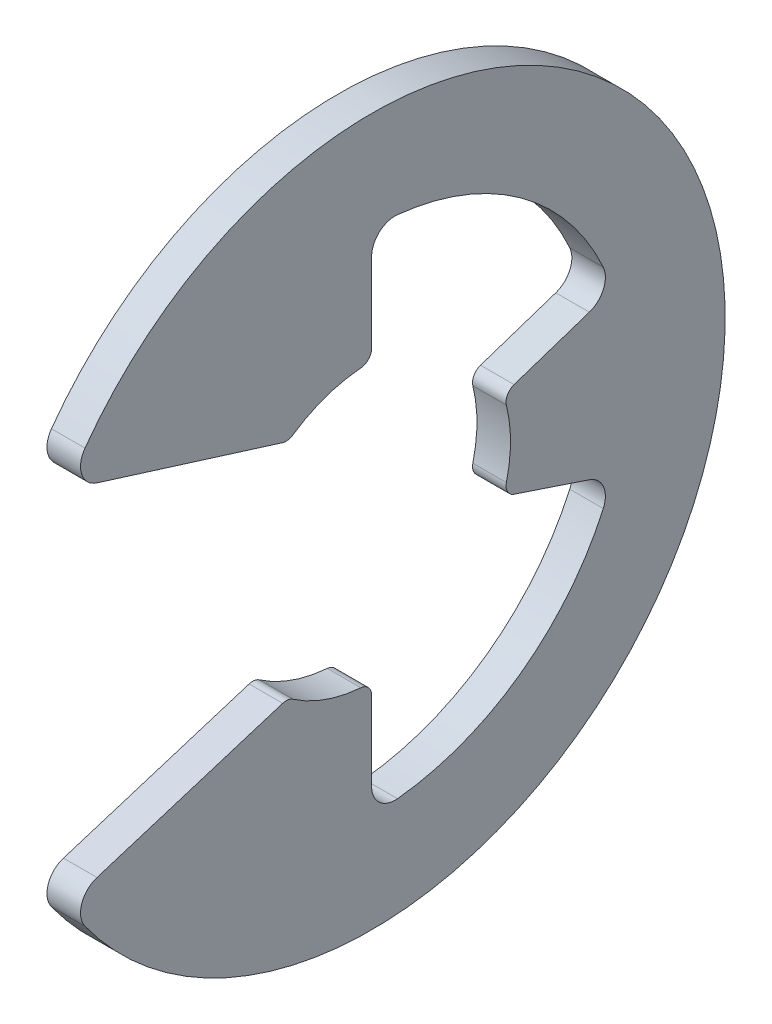
ISO-10303-21;
HEADER;
FILE_DESCRIPTION(('STEP AP214'),'2;1');
FILE_NAME('part.step','',(''),(''),'','','');
FILE_SCHEMA(('AUTOMOTIVE_DESIGN { 1 0 10303 214 1 1 1 1 }'));
ENDSEC;
DATA;
#1=APPLICATION_CONTEXT('core data for automotive mechanical design processes');
#2=APPLICATION_PROTOCOL_DEFINITION('international standard','automotive_design',2000,#1);
#3=PRODUCT_CONTEXT('',#1,'mechanical');
#4=PRODUCT('Part','Part','',(#3));
#5=PRODUCT_RELATED_PRODUCT_CATEGORY('part','',(#4));
#6=PRODUCT_DEFINITION_FORMATION('','',#4);
#7=PRODUCT_DEFINITION_CONTEXT('part definition',#1,'design');
#8=PRODUCT_DEFINITION('design','',#6,#7);
#9=PRODUCT_DEFINITION_SHAPE('','',#8);
#10=(LENGTH_UNIT() NAMED_UNIT(*) SI_UNIT(.MILLI.,.METRE.));
#11=(NAMED_UNIT(*) PLANE_ANGLE_UNIT() SI_UNIT($,.RADIAN.));
#12=(NAMED_UNIT(*) SI_UNIT($,.STERADIAN.) SOLID_ANGLE_UNIT());
#13=UNCERTAINTY_MEASURE_WITH_UNIT(LENGTH_MEASURE(1.E-05),#10,'distance_accuracy_value','');
#14=(GEOMETRIC_REPRESENTATION_CONTEXT(3) GLOBAL_UNCERTAINTY_ASSIGNED_CONTEXT((#13)) GLOBAL_UNIT_ASSIGNED_CONTEXT((#10,
#11,#12)) REPRESENTATION_CONTEXT('',''));
#15=CARTESIAN_POINT('',(0.,0.,0.));
#16=DIRECTION('',(0.,0.,1.));
#17=DIRECTION('',(1.,0.,0.));
#18=AXIS2_PLACEMENT_3D('',#15,#16,#17);
#19=CARTESIAN_POINT('',(0.3175,0.,0.));
#20=DIRECTION('',(-1.,0.,0.));
#21=DIRECTION('',(0.,0.,1.));
#22=AXIS2_PLACEMENT_3D('',#19,#20,#21);
#23=CYLINDRICAL_SURFACE('',#22,2.6289);
#24=CARTESIAN_POINT('',(0.3175,0.,0.));
#25=DIRECTION('',(-1.,0.,0.));
#26=DIRECTION('',(0.,0.,-1.));
#27=AXIS2_PLACEMENT_3D('',#24,#25,#26);
#28=CIRCLE('',#27,2.6289);
#29=CARTESIAN_POINT('',(0.3175,0.634392297731757,-2.55120787521884));
#30=VERTEX_POINT('',#29);
#31=CARTESIAN_POINT('',(0.3175,-0.634392297731756,-2.55120787521884));
#32=VERTEX_POINT('',#31);
#33=EDGE_CURVE('E246',#30,#32,#28,.T.);
#34=ORIENTED_EDGE('',*,*,#33,.F.);
#35=DIRECTION('',(-1.,0.,0.));
#36=VECTOR('',#35,1.);
#37=CARTESIAN_POINT('',(0.3175,0.634392297731757,-2.55120787521884));
#38=LINE('',#37,#36);
#39=CARTESIAN_POINT('',(-0.3175,0.634392297731757,-2.55120787521884));
#40=VERTEX_POINT('',#39);
#41=EDGE_CURVE('E360',#30,#40,#38,.T.);
#42=ORIENTED_EDGE('',*,*,#41,.T.);
#43=CARTESIAN_POINT('',(-0.3175,0.,0.));
#44=DIRECTION('',(-1.,0.,0.));
#45=DIRECTION('',(0.,0.,-1.));
#46=AXIS2_PLACEMENT_3D('',#43,#44,#45);
#47=CIRCLE('',#46,2.6289);
#48=CARTESIAN_POINT('',(-0.3175,-0.634392297731756,-2.55120787521884));
#49=VERTEX_POINT('',#48);
#50=EDGE_CURVE('E419',#40,#49,#47,.T.);
#51=ORIENTED_EDGE('',*,*,#50,.T.);
#52=DIRECTION('',(-1.,0.,0.));
#53=VECTOR('',#52,1.);
#54=CARTESIAN_POINT('',(0.3175,-0.634392297731757,-2.55120787521884));
#55=LINE('',#54,#53);
#56=EDGE_CURVE('E60',#49,#32,#55,.F.);
#57=ORIENTED_EDGE('',*,*,#56,.T.);
#58=EDGE_LOOP('',(#34,#42,#51,#57));
#59=FACE_BOUND('',#58,.T.);
#60=ADVANCED_FACE('F37',(#59),#23,.F.);
#61=CARTESIAN_POINT('',(0.3175,-0.831331174081665,-2.493993522245));
#62=DIRECTION('',(0.,0.948683298050514,-0.316227766016838));
#63=DIRECTION('',(0.,0.316227766016838,0.948683298050514));
#64=AXIS2_PLACEMENT_3D('',#61,#62,#63);
#65=PLANE('',#64);
#66=DIRECTION('',(0.,-0.316227766016838,-0.948683298050514));
#67=VECTOR('',#66,1.);
#68=CARTESIAN_POINT('',(0.3175,-0.831331174081665,-2.493993522245));
#69=LINE('',#68,#67);
#70=CARTESIAN_POINT('',(0.3175,-0.898869359807086,-2.69660807942126));
#71=VERTEX_POINT('',#70);
#72=CARTESIAN_POINT('',(0.3175,-1.37371537804572,-4.12114613413716));
#73=VERTEX_POINT('',#72);
#74=EDGE_CURVE('E248',#71,#73,#69,.T.);
#75=ORIENTED_EDGE('',*,*,#74,.F.);
#76=DIRECTION('',(-1.,0.,0.));
#77=VECTOR('',#76,1.);
#78=CARTESIAN_POINT('',(0.3175,-0.898869359807086,-2.69660807942126));
#79=LINE('',#78,#77);
#80=CARTESIAN_POINT('',(-0.3175,-0.898869359807086,-2.69660807942126));
#81=VERTEX_POINT('',#80);
#82=EDGE_CURVE('E365',#71,#81,#79,.T.);
#83=ORIENTED_EDGE('',*,*,#82,.T.);
#84=DIRECTION('',(0.,-0.316227766016838,-0.948683298050514));
#85=VECTOR('',#84,1.);
#86=CARTESIAN_POINT('',(-0.3175,-0.831331174081665,-2.493993522245));
#87=LINE('',#86,#85);
#88=CARTESIAN_POINT('',(-0.3175,-1.37371537804572,-4.12114613413716));
#89=VERTEX_POINT('',#88);
#90=EDGE_CURVE('E421',#81,#89,#87,.T.);
#91=ORIENTED_EDGE('',*,*,#90,.T.);
#92=DIRECTION('',(1.,0.,0.));
#93=VECTOR('',#92,1.);
#94=CARTESIAN_POINT('',(0.3175,-1.37371537804572,-4.12114613413716));
#95=LINE('',#94,#93);
#96=EDGE_CURVE('E294',#89,#73,#95,.T.);
#97=ORIENTED_EDGE('',*,*,#96,.T.);
#98=EDGE_LOOP('',(#75,#83,#91,#97));
#99=FACE_BOUND('',#98,.T.);
#100=ADVANCED_FACE('F457',(#99),#65,.F.);
#101=CARTESIAN_POINT('',(0.3175,0.,0.));
#102=DIRECTION('',(-1.,0.,0.));
#103=DIRECTION('',(0.,0.,1.));
#104=AXIS2_PLACEMENT_3D('',#101,#102,#103);
#105=CYLINDRICAL_SURFACE('',#104,4.81125161290323);
#106=CARTESIAN_POINT('',(-0.3175,0.,0.));
#107=DIRECTION('',(-1.,0.,0.));
#108=DIRECTION('',(0.,0.,-1.));
#109=AXIS2_PLACEMENT_3D('',#106,#107,#108);
#110=CIRCLE('',#109,4.81125161290323);
#111=CARTESIAN_POINT('',(-0.3175,-1.97816282406592,-4.38577403933986));
#112=VERTEX_POINT('',#111);
#113=CARTESIAN_POINT('',(-0.3175,-4.78626059081718,-0.489746505300684));
#114=VERTEX_POINT('',#113);
#115=EDGE_CURVE('E423',#112,#114,#110,.T.);
#116=ORIENTED_EDGE('',*,*,#115,.T.);
#117=DIRECTION('',(-1.,0.,0.));
#118=VECTOR('',#117,1.);
#119=CARTESIAN_POINT('',(0.3175,-4.78626059081718,-0.489746505300684));
#120=LINE('',#119,#118);
#121=CARTESIAN_POINT('',(0.3175,-4.78626059081718,-0.489746505300684));
#122=VERTEX_POINT('',#121);
#123=EDGE_CURVE('E292',#114,#122,#120,.F.);
#124=ORIENTED_EDGE('',*,*,#123,.T.);
#125=CARTESIAN_POINT('',(0.3175,0.,0.));
#126=DIRECTION('',(-1.,0.,0.));
#127=DIRECTION('',(0.,0.,-1.));
#128=AXIS2_PLACEMENT_3D('',#125,#126,#127);
#129=CIRCLE('',#128,4.81125161290323);
#130=CARTESIAN_POINT('',(0.3175,-1.97816282406592,-4.38577403933986));
#131=VERTEX_POINT('',#130);
#132=EDGE_CURVE('E250',#131,#122,#129,.T.);
#133=ORIENTED_EDGE('',*,*,#132,.F.);
#134=DIRECTION('',(-1.,0.,0.));
#135=VECTOR('',#134,1.);
#136=CARTESIAN_POINT('',(0.3175,-1.97816282406592,-4.38577403933986));
#137=LINE('',#136,#135);
#138=EDGE_CURVE('E289',#131,#112,#137,.T.);
#139=ORIENTED_EDGE('',*,*,#138,.T.);
#140=EDGE_LOOP('',(#116,#124,#133,#139));
#141=FACE_BOUND('',#140,.T.);
#142=ADVANCED_FACE('F462',(#141),#105,.F.);
#143=CARTESIAN_POINT('',(0.3175,-4.81125161290323,0.));
#144=DIRECTION('',(0.,0.,1.));
#145=DIRECTION('',(0.,-1.,0.));
#146=AXIS2_PLACEMENT_3D('',#143,#144,#145);
#147=PLANE('',#146);
#148=DIRECTION('',(0.,1.,0.));
#149=VECTOR('',#148,1.);
#150=CARTESIAN_POINT('',(-0.3175,-4.81125161290323,0.));
#151=LINE('',#150,#149);
#152=CARTESIAN_POINT('',(-0.3175,-4.34406945142374,0.));
#153=VERTEX_POINT('',#152);
#154=CARTESIAN_POINT('',(-0.3175,-2.8424744959278,0.));
#155=VERTEX_POINT('',#154);
#156=EDGE_CURVE('E428',#153,#155,#151,.T.);
#157=ORIENTED_EDGE('',*,*,#156,.T.);
#158=DIRECTION('',(-1.,0.,0.));
#159=VECTOR('',#158,1.);
#160=CARTESIAN_POINT('',(0.3175,-2.8424744959278,0.));
#161=LINE('',#160,#159);
#162=CARTESIAN_POINT('',(0.3175,-2.8424744959278,0.));
#163=VERTEX_POINT('',#162);
#164=EDGE_CURVE('E343',#155,#163,#161,.F.);
#165=ORIENTED_EDGE('',*,*,#164,.T.);
#166=DIRECTION('',(0.,1.,0.));
#167=VECTOR('',#166,1.);
#168=CARTESIAN_POINT('',(0.3175,-4.81125161290323,0.));
#169=LINE('',#168,#167);
#170=CARTESIAN_POINT('',(0.3175,-4.34406945142374,0.));
#171=VERTEX_POINT('',#170);
#172=EDGE_CURVE('E253',#171,#163,#169,.T.);
#173=ORIENTED_EDGE('',*,*,#172,.F.);
#174=DIRECTION('',(1.,0.,0.));
#175=VECTOR('',#174,1.);
#176=CARTESIAN_POINT('',(-0.3175,-4.34406945142374,0.));
#177=LINE('',#176,#175);
#178=EDGE_CURVE('E286',#171,#153,#177,.F.);
#179=ORIENTED_EDGE('',*,*,#178,.T.);
#180=EDGE_LOOP('',(#157,#165,#173,#179));
#181=FACE_BOUND('',#180,.T.);
#182=ADVANCED_FACE('F468',(#181),#147,.F.);
#183=CARTESIAN_POINT('',(0.3175,0.,0.));
#184=DIRECTION('',(-1.,0.,0.));
#185=DIRECTION('',(0.,0.,1.));
#186=AXIS2_PLACEMENT_3D('',#183,#184,#185);
#187=CYLINDRICAL_SURFACE('',#186,2.6289);
#188=CARTESIAN_POINT('',(0.3175,0.,0.));
#189=DIRECTION('',(-1.,0.,0.));
#190=DIRECTION('',(0.,0.,-1.));
#191=AXIS2_PLACEMENT_3D('',#188,#189,#190);
#192=CIRCLE('',#191,2.6289);
#193=CARTESIAN_POINT('',(0.3175,-2.62090076016505,0.204925389755011));
#194=VERTEX_POINT('',#193);
#195=CARTESIAN_POINT('',(0.3175,-2.16527043809185,1.490878646948));
#196=VERTEX_POINT('',#195);
#197=EDGE_CURVE('E256',#194,#196,#192,.T.);
#198=ORIENTED_EDGE('',*,*,#197,.F.);
#199=DIRECTION('',(-1.,0.,0.));
#200=VECTOR('',#199,1.);
#201=CARTESIAN_POINT('',(0.3175,-2.62090076016505,0.204925389755011));
#202=LINE('',#201,#200);
#203=CARTESIAN_POINT('',(-0.3175,-2.62090076016505,0.204925389755011));
#204=VERTEX_POINT('',#203);
#205=EDGE_CURVE('E328',#194,#204,#202,.T.);
#206=ORIENTED_EDGE('',*,*,#205,.T.);
#207=CARTESIAN_POINT('',(-0.3175,0.,0.));
#208=DIRECTION('',(-1.,0.,0.));
#209=DIRECTION('',(0.,0.,-1.));
#210=AXIS2_PLACEMENT_3D('',#207,#208,#209);
#211=CIRCLE('',#210,2.6289);
#212=CARTESIAN_POINT('',(-0.3175,-2.16527043809185,1.490878646948));
#213=VERTEX_POINT('',#212);
#214=EDGE_CURVE('E232',#204,#213,#211,.T.);
#215=ORIENTED_EDGE('',*,*,#214,.T.);
#216=DIRECTION('',(-1.,0.,0.));
#217=VECTOR('',#216,1.);
#218=CARTESIAN_POINT('',(0.3175,-2.16527043809185,1.490878646948));
#219=LINE('',#218,#217);
#220=EDGE_CURVE('E326',#213,#196,#219,.F.);
#221=ORIENTED_EDGE('',*,*,#220,.T.);
#222=EDGE_LOOP('',(#198,#206,#215,#221));
#223=FACE_BOUND('',#222,.T.);
#224=ADVANCED_FACE('F434',(#223),#187,.F.);
#225=CARTESIAN_POINT('',(0.3175,-2.10312,1.57734));
#226=DIRECTION('',(0.,-0.954513538836349,-0.29816757734219));
#227=DIRECTION('',(0.,0.29816757734219,-0.954513538836349));
#228=AXIS2_PLACEMENT_3D('',#225,#226,#227);
#229=PLANE('',#228);
#230=DIRECTION('',(0.,-0.29816757734219,0.954513538836348));
#231=VECTOR('',#230,1.);
#232=CARTESIAN_POINT('',(0.3175,-2.10312,1.57734));
#233=LINE('',#232,#231);
#234=CARTESIAN_POINT('',(0.3175,-2.13618406817537,1.683186856334));
#235=VERTEX_POINT('',#234);
#236=CARTESIAN_POINT('',(0.3175,-3.2341191064352,5.19796826926775));
#237=VERTEX_POINT('',#236);
#238=EDGE_CURVE('E259',#235,#237,#233,.T.);
#239=ORIENTED_EDGE('',*,*,#238,.F.);
#240=DIRECTION('',(-1.,0.,0.));
#241=VECTOR('',#240,1.);
#242=CARTESIAN_POINT('',(0.3175,-2.13618406817537,1.683186856334));
#243=LINE('',#242,#241);
#244=CARTESIAN_POINT('',(-0.3175,-2.13618406817537,1.683186856334));
#245=VERTEX_POINT('',#244);
#246=EDGE_CURVE('E356',#235,#245,#243,.T.);
#247=ORIENTED_EDGE('',*,*,#246,.T.);
#248=DIRECTION('',(0.,-0.29816757734219,0.954513538836348));
#249=VECTOR('',#248,1.);
#250=CARTESIAN_POINT('',(-0.3175,-2.10312,1.57734));
#251=LINE('',#250,#249);
#252=CARTESIAN_POINT('',(-0.3175,-3.2341191064352,5.19796826926775));
#253=VERTEX_POINT('',#252);
#254=EDGE_CURVE('E227',#245,#253,#251,.T.);
#255=ORIENTED_EDGE('',*,*,#254,.T.);
#256=DIRECTION('',(-1.,0.,0.));
#257=VECTOR('',#256,1.);
#258=CARTESIAN_POINT('',(0.3175,-3.2341191064352,5.19796826926775));
#259=LINE('',#258,#257);
#260=EDGE_CURVE('E207',#253,#237,#259,.F.);
#261=ORIENTED_EDGE('',*,*,#260,.T.);
#262=EDGE_LOOP('',(#239,#247,#255,#261));
#263=FACE_BOUND('',#262,.T.);
#264=ADVANCED_FACE('F442',(#263),#229,.F.);
#265=CARTESIAN_POINT('',(0.3175,0.,0.));
#266=DIRECTION('',(-1.,0.,0.));
#267=DIRECTION('',(0.,0.,1.));
#268=AXIS2_PLACEMENT_3D('',#265,#266,#267);
#269=CYLINDRICAL_SURFACE('',#268,6.6929);
#270=CARTESIAN_POINT('',(0.3175,0.,0.));
#271=DIRECTION('',(1.,0.,0.));
#272=DIRECTION('',(0.,0.,-1.));
#273=AXIS2_PLACEMENT_3D('',#270,#271,#272);
#274=CIRCLE('',#273,6.6929);
#275=CARTESIAN_POINT('',(0.3175,-3.91865243360584,5.42577860906571));
#276=VERTEX_POINT('',#275);
#277=CARTESIAN_POINT('',(0.3175,3.91865243360584,5.42577860906571));
#278=VERTEX_POINT('',#277);
#279=EDGE_CURVE('E220',#276,#278,#274,.T.);
#280=ORIENTED_EDGE('',*,*,#279,.F.);
#281=DIRECTION('',(-1.,0.,0.));
#282=VECTOR('',#281,1.);
#283=CARTESIAN_POINT('',(0.3175,-3.91865243360584,5.42577860906571));
#284=LINE('',#283,#282);
#285=CARTESIAN_POINT('',(-0.3175,-3.91865243360584,5.42577860906571));
#286=VERTEX_POINT('',#285);
#287=EDGE_CURVE('E205',#276,#286,#284,.T.);
#288=ORIENTED_EDGE('',*,*,#287,.T.);
#289=CARTESIAN_POINT('',(-0.3175,0.,0.));
#290=DIRECTION('',(1.,0.,0.));
#291=DIRECTION('',(0.,0.,-1.));
#292=AXIS2_PLACEMENT_3D('',#289,#290,#291);
#293=CIRCLE('',#292,6.6929);
#294=CARTESIAN_POINT('',(-0.3175,3.91865243360584,5.42577860906571));
#295=VERTEX_POINT('',#294);
#296=EDGE_CURVE('E217',#286,#295,#293,.T.);
#297=ORIENTED_EDGE('',*,*,#296,.T.);
#298=DIRECTION('',(-1.,0.,0.));
#299=VECTOR('',#298,1.);
#300=CARTESIAN_POINT('',(0.3175,3.91865243360584,5.42577860906571));
#301=LINE('',#300,#299);
#302=EDGE_CURVE('E221',#295,#278,#301,.F.);
#303=ORIENTED_EDGE('',*,*,#302,.T.);
#304=EDGE_LOOP('',(#280,#288,#297,#303));
#305=FACE_BOUND('',#304,.T.);
#306=ADVANCED_FACE('F216',(#305),#269,.T.);
#307=CARTESIAN_POINT('',(0.3175,3.40948689870738,5.75936710911388));
#308=DIRECTION('',(0.,0.954513538836349,-0.298167577342189));
#309=DIRECTION('',(0.,0.298167577342189,0.954513538836349));
#310=AXIS2_PLACEMENT_3D('',#307,#308,#309);
#311=PLANE('',#310);
#312=DIRECTION('',(0.,-0.298167577342189,-0.954513538836349));
#313=VECTOR('',#312,1.);
#314=CARTESIAN_POINT('',(-0.3175,3.40948689870738,5.75936710911388));
#315=LINE('',#314,#313);
#316=CARTESIAN_POINT('',(-0.3175,3.2341191064352,5.19796826926775));
#317=VERTEX_POINT('',#316);
#318=CARTESIAN_POINT('',(-0.3175,2.13618406817537,1.683186856334));
#319=VERTEX_POINT('',#318);
#320=EDGE_CURVE('E226',#317,#319,#315,.T.);
#321=ORIENTED_EDGE('',*,*,#320,.T.);
#322=DIRECTION('',(-1.,0.,0.));
#323=VECTOR('',#322,1.);
#324=CARTESIAN_POINT('',(0.3175,2.13618406817537,1.683186856334));
#325=LINE('',#324,#323);
#326=CARTESIAN_POINT('',(0.3175,2.13618406817537,1.683186856334));
#327=VERTEX_POINT('',#326);
#328=EDGE_CURVE('E45',#319,#327,#325,.F.);
#329=ORIENTED_EDGE('',*,*,#328,.T.);
#330=DIRECTION('',(0.,-0.298167577342189,-0.954513538836349));
#331=VECTOR('',#330,1.);
#332=CARTESIAN_POINT('',(0.3175,3.40948689870738,5.75936710911388));
#333=LINE('',#332,#331);
#334=CARTESIAN_POINT('',(0.3175,3.2341191064352,5.19796826926775));
#335=VERTEX_POINT('',#334);
#336=EDGE_CURVE('E262',#335,#327,#333,.T.);
#337=ORIENTED_EDGE('',*,*,#336,.F.);
#338=DIRECTION('',(-1.,0.,0.));
#339=VECTOR('',#338,1.);
#340=CARTESIAN_POINT('',(0.3175,3.2341191064352,5.19796826926775));
#341=LINE('',#340,#339);
#342=EDGE_CURVE('E283',#335,#317,#341,.T.);
#343=ORIENTED_EDGE('',*,*,#342,.T.);
#344=EDGE_LOOP('',(#321,#329,#337,#343));
#345=FACE_BOUND('',#344,.T.);
#346=ADVANCED_FACE('F375',(#345),#311,.F.);
#347=CARTESIAN_POINT('',(0.3175,0.,0.));
#348=DIRECTION('',(-1.,0.,0.));
#349=DIRECTION('',(0.,0.,1.));
#350=AXIS2_PLACEMENT_3D('',#347,#348,#349);
#351=CYLINDRICAL_SURFACE('',#350,2.6289);
#352=CARTESIAN_POINT('',(0.3175,0.,0.));
#353=DIRECTION('',(-1.,0.,0.));
#354=DIRECTION('',(0.,0.,-1.));
#355=AXIS2_PLACEMENT_3D('',#352,#353,#354);
#356=CIRCLE('',#355,2.6289);
#357=CARTESIAN_POINT('',(0.3175,2.16527043809185,1.49087864694801));
#358=VERTEX_POINT('',#357);
#359=CARTESIAN_POINT('',(0.3175,2.62090076016505,0.204925389755012));
#360=VERTEX_POINT('',#359);
#361=EDGE_CURVE('E265',#358,#360,#356,.T.);
#362=ORIENTED_EDGE('',*,*,#361,.F.);
#363=DIRECTION('',(-1.,0.,0.));
#364=VECTOR('',#363,1.);
#365=CARTESIAN_POINT('',(0.3175,2.16527043809185,1.49087864694801));
#366=LINE('',#365,#364);
#367=CARTESIAN_POINT('',(-0.3175,2.16527043809185,1.49087864694801));
#368=VERTEX_POINT('',#367);
#369=EDGE_CURVE('E370',#358,#368,#366,.T.);
#370=ORIENTED_EDGE('',*,*,#369,.T.);
#371=CARTESIAN_POINT('',(-0.3175,0.,0.));
#372=DIRECTION('',(-1.,0.,0.));
#373=DIRECTION('',(0.,0.,-1.));
#374=AXIS2_PLACEMENT_3D('',#371,#372,#373);
#375=CIRCLE('',#374,2.6289);
#376=CARTESIAN_POINT('',(-0.3175,2.62090076016505,0.204925389755012));
#377=VERTEX_POINT('',#376);
#378=EDGE_CURVE('E230',#368,#377,#375,.T.);
#379=ORIENTED_EDGE('',*,*,#378,.T.);
#380=DIRECTION('',(-1.,0.,0.));
#381=VECTOR('',#380,1.);
#382=CARTESIAN_POINT('',(0.3175,2.62090076016505,0.204925389755012));
#383=LINE('',#382,#381);
#384=EDGE_CURVE('E368',#377,#360,#383,.F.);
#385=ORIENTED_EDGE('',*,*,#384,.T.);
#386=EDGE_LOOP('',(#362,#370,#379,#385));
#387=FACE_BOUND('',#386,.T.);
#388=ADVANCED_FACE('F386',(#387),#351,.F.);
#389=CARTESIAN_POINT('',(0.3175,2.6289,0.));
#390=DIRECTION('',(0.,0.,1.));
#391=DIRECTION('',(0.,-1.,0.));
#392=AXIS2_PLACEMENT_3D('',#389,#390,#391);
#393=PLANE('',#392);
#394=DIRECTION('',(0.,1.,0.));
#395=VECTOR('',#394,1.);
#396=CARTESIAN_POINT('',(0.3175,2.6289,0.));
#397=LINE('',#396,#395);
#398=CARTESIAN_POINT('',(0.3175,2.8424744959278,0.));
#399=VERTEX_POINT('',#398);
#400=CARTESIAN_POINT('',(0.3175,4.34406945142374,0.));
#401=VERTEX_POINT('',#400);
#402=EDGE_CURVE('E268',#399,#401,#397,.T.);
#403=ORIENTED_EDGE('',*,*,#402,.F.);
#404=DIRECTION('',(-1.,0.,0.));
#405=VECTOR('',#404,1.);
#406=CARTESIAN_POINT('',(0.3175,2.8424744959278,0.));
#407=LINE('',#406,#405);
#408=CARTESIAN_POINT('',(-0.3175,2.8424744959278,0.));
#409=VERTEX_POINT('',#408);
#410=EDGE_CURVE('E11',#399,#409,#407,.T.);
#411=ORIENTED_EDGE('',*,*,#410,.T.);
#412=DIRECTION('',(0.,1.,0.));
#413=VECTOR('',#412,1.);
#414=CARTESIAN_POINT('',(-0.3175,2.6289,0.));
#415=LINE('',#414,#413);
#416=CARTESIAN_POINT('',(-0.3175,4.34406945142374,0.));
#417=VERTEX_POINT('',#416);
#418=EDGE_CURVE('E238',#409,#417,#415,.T.);
#419=ORIENTED_EDGE('',*,*,#418,.T.);
#420=DIRECTION('',(1.,0.,0.));
#421=VECTOR('',#420,1.);
#422=CARTESIAN_POINT('',(0.3175,4.34406945142374,0.));
#423=LINE('',#422,#421);
#424=EDGE_CURVE('E305',#417,#401,#423,.T.);
#425=ORIENTED_EDGE('',*,*,#424,.T.);
#426=EDGE_LOOP('',(#403,#411,#419,#425));
#427=FACE_BOUND('',#426,.T.);
#428=ADVANCED_FACE('F394',(#427),#393,.F.);
#429=CARTESIAN_POINT('',(0.3175,0.,0.));
#430=DIRECTION('',(-1.,0.,0.));
#431=DIRECTION('',(0.,0.,1.));
#432=AXIS2_PLACEMENT_3D('',#429,#430,#431);
#433=CYLINDRICAL_SURFACE('',#432,4.81125161290323);
#434=CARTESIAN_POINT('',(-0.3175,0.,0.));
#435=DIRECTION('',(-1.,0.,0.));
#436=DIRECTION('',(0.,0.,-1.));
#437=AXIS2_PLACEMENT_3D('',#434,#435,#436);
#438=CIRCLE('',#437,4.81125161290323);
#439=CARTESIAN_POINT('',(-0.3175,4.78626059081718,-0.489746505300684));
#440=VERTEX_POINT('',#439);
#441=CARTESIAN_POINT('',(-0.3175,1.97816282406592,-4.38577403933986));
#442=VERTEX_POINT('',#441);
#443=EDGE_CURVE('E240',#440,#442,#438,.T.);
#444=ORIENTED_EDGE('',*,*,#443,.T.);
#445=DIRECTION('',(-1.,0.,0.));
#446=VECTOR('',#445,1.);
#447=CARTESIAN_POINT('',(0.3175,1.97816282406592,-4.38577403933986));
#448=LINE('',#447,#446);
#449=CARTESIAN_POINT('',(0.3175,1.97816282406592,-4.38577403933986));
#450=VERTEX_POINT('',#449);
#451=EDGE_CURVE('E303',#442,#450,#448,.F.);
#452=ORIENTED_EDGE('',*,*,#451,.T.);
#453=CARTESIAN_POINT('',(0.3175,0.,0.));
#454=DIRECTION('',(-1.,0.,0.));
#455=DIRECTION('',(0.,0.,-1.));
#456=AXIS2_PLACEMENT_3D('',#453,#454,#455);
#457=CIRCLE('',#456,4.81125161290323);
#458=CARTESIAN_POINT('',(0.3175,4.78626059081718,-0.489746505300684));
#459=VERTEX_POINT('',#458);
#460=EDGE_CURVE('E270',#459,#450,#457,.T.);
#461=ORIENTED_EDGE('',*,*,#460,.F.);
#462=DIRECTION('',(-1.,0.,0.));
#463=VECTOR('',#462,1.);
#464=CARTESIAN_POINT('',(0.3175,4.78626059081718,-0.489746505300684));
#465=LINE('',#464,#463);
#466=EDGE_CURVE('E300',#459,#440,#465,.T.);
#467=ORIENTED_EDGE('',*,*,#466,.T.);
#468=EDGE_LOOP('',(#444,#452,#461,#467));
#469=FACE_BOUND('',#468,.T.);
#470=ADVANCED_FACE('F402',(#469),#433,.F.);
#471=CARTESIAN_POINT('',(0.3175,1.5214513492933,-4.56435404787989));
#472=DIRECTION('',(0.,-0.948683298050514,-0.316227766016838));
#473=DIRECTION('',(0.,0.316227766016838,-0.948683298050514));
#474=AXIS2_PLACEMENT_3D('',#471,#472,#473);
#475=PLANE('',#474);
#476=DIRECTION('',(0.,-0.316227766016838,0.948683298050514));
#477=VECTOR('',#476,1.);
#478=CARTESIAN_POINT('',(-0.3175,1.5214513492933,-4.56435404787989));
#479=LINE('',#478,#477);
#480=CARTESIAN_POINT('',(-0.3175,1.37371537804572,-4.12114613413716));
#481=VERTEX_POINT('',#480);
#482=CARTESIAN_POINT('',(-0.3175,0.898869359807086,-2.69660807942126));
#483=VERTEX_POINT('',#482);
#484=EDGE_CURVE('E243',#481,#483,#479,.T.);
#485=ORIENTED_EDGE('',*,*,#484,.T.);
#486=DIRECTION('',(-1.,0.,0.));
#487=VECTOR('',#486,1.);
#488=CARTESIAN_POINT('',(0.3175,0.898869359807086,-2.69660807942126));
#489=LINE('',#488,#487);
#490=CARTESIAN_POINT('',(0.3175,0.898869359807086,-2.69660807942126));
#491=VERTEX_POINT('',#490);
#492=EDGE_CURVE('E363',#483,#491,#489,.F.);
#493=ORIENTED_EDGE('',*,*,#492,.T.);
#494=DIRECTION('',(0.,-0.316227766016838,0.948683298050514));
#495=VECTOR('',#494,1.);
#496=CARTESIAN_POINT('',(0.3175,1.5214513492933,-4.56435404787989));
#497=LINE('',#496,#495);
#498=CARTESIAN_POINT('',(0.3175,1.37371537804572,-4.12114613413716));
#499=VERTEX_POINT('',#498);
#500=EDGE_CURVE('E273',#499,#491,#497,.T.);
#501=ORIENTED_EDGE('',*,*,#500,.F.);
#502=DIRECTION('',(1.,0.,0.));
#503=VECTOR('',#502,1.);
#504=CARTESIAN_POINT('',(-0.3175,1.37371537804572,-4.12114613413716));
#505=LINE('',#504,#503);
#506=EDGE_CURVE('E297',#499,#481,#505,.F.);
#507=ORIENTED_EDGE('',*,*,#506,.T.);
#508=EDGE_LOOP('',(#485,#493,#501,#507));
#509=FACE_BOUND('',#508,.T.);
#510=ADVANCED_FACE('F413',(#509),#475,.F.);
#511=CARTESIAN_POINT('',(0.3175,0.,0.));
#512=DIRECTION('',(1.,0.,0.));
#513=DIRECTION('',(0.,0.,-1.));
#514=AXIS2_PLACEMENT_3D('',#511,#512,#513);
#515=PLANE('',#514);
#516=ORIENTED_EDGE('',*,*,#172,.T.);
#517=CARTESIAN_POINT('',(0.3175,-2.8424744959278,0.22225));
#518=DIRECTION('',(1.,0.,0.));
#519=DIRECTION('',(0.,0.,-1.));
#520=AXIS2_PLACEMENT_3D('',#517,#518,#519);
#521=CIRCLE('',#520,0.22225);
#522=EDGE_CURVE('E354',#163,#194,#521,.T.);
#523=ORIENTED_EDGE('',*,*,#522,.T.);
#524=ORIENTED_EDGE('',*,*,#197,.T.);
#525=CARTESIAN_POINT('',(0.3175,-2.34832470218174,1.6169191122697));
#526=DIRECTION('',(1.,0.,0.));
#527=DIRECTION('',(0.,0.,-1.));
#528=AXIS2_PLACEMENT_3D('',#525,#526,#527);
#529=CIRCLE('',#528,0.22225);
#530=EDGE_CURVE('E352',#196,#235,#529,.T.);
#531=ORIENTED_EDGE('',*,*,#530,.T.);
#532=ORIENTED_EDGE('',*,*,#238,.T.);
#533=CARTESIAN_POINT('',(0.3175,-3.65840037444796,5.06543278113915));
#534=DIRECTION('',(1.,0.,0.));
#535=DIRECTION('',(0.,0.,-1.));
#536=AXIS2_PLACEMENT_3D('',#533,#534,#535);
#537=CIRCLE('',#536,0.4445);
#538=EDGE_CURVE('E281',#237,#276,#537,.T.);
#539=ORIENTED_EDGE('',*,*,#538,.T.);
#540=ORIENTED_EDGE('',*,*,#279,.T.);
#541=CARTESIAN_POINT('',(0.3175,3.65840037444795,5.06543278113915));
#542=DIRECTION('',(1.,0.,0.));
#543=DIRECTION('',(0.,0.,-1.));
#544=AXIS2_PLACEMENT_3D('',#541,#542,#543);
#545=CIRCLE('',#544,0.4445);
#546=EDGE_CURVE('E279',#278,#335,#545,.T.);
#547=ORIENTED_EDGE('',*,*,#546,.T.);
#548=ORIENTED_EDGE('',*,*,#336,.T.);
#549=CARTESIAN_POINT('',(0.3175,2.34832470218174,1.6169191122697));
#550=DIRECTION('',(1.,0.,0.));
#551=DIRECTION('',(0.,0.,-1.));
#552=AXIS2_PLACEMENT_3D('',#549,#550,#551);
#553=CIRCLE('',#552,0.22225);
#554=EDGE_CURVE('E347',#327,#358,#553,.T.);
#555=ORIENTED_EDGE('',*,*,#554,.T.);
#556=ORIENTED_EDGE('',*,*,#361,.T.);
#557=CARTESIAN_POINT('',(0.3175,2.8424744959278,0.222250000000001));
#558=DIRECTION('',(1.,0.,0.));
#559=DIRECTION('',(0.,0.,-1.));
#560=AXIS2_PLACEMENT_3D('',#557,#558,#559);
#561=CIRCLE('',#560,0.22225);
#562=EDGE_CURVE('E345',#360,#399,#561,.T.);
#563=ORIENTED_EDGE('',*,*,#562,.T.);
#564=ORIENTED_EDGE('',*,*,#402,.T.);
#565=CARTESIAN_POINT('',(0.3175,4.34406945142374,-0.444499999999999));
#566=DIRECTION('',(1.,0.,0.));
#567=DIRECTION('',(0.,0.,-1.));
#568=AXIS2_PLACEMENT_3D('',#565,#566,#567);
#569=CIRCLE('',#568,0.4445);
#570=EDGE_CURVE('E324',#401,#459,#569,.F.);
#571=ORIENTED_EDGE('',*,*,#570,.T.);
#572=ORIENTED_EDGE('',*,*,#460,.T.);
#573=CARTESIAN_POINT('',(0.3175,1.79540510402917,-3.98058289214267));
#574=DIRECTION('',(1.,0.,0.));
#575=DIRECTION('',(0.,0.,-1.));
#576=AXIS2_PLACEMENT_3D('',#573,#574,#575);
#577=CIRCLE('',#576,0.4445);
#578=EDGE_CURVE('E319',#450,#499,#577,.F.);
#579=ORIENTED_EDGE('',*,*,#578,.T.);
#580=ORIENTED_EDGE('',*,*,#500,.T.);
#581=CARTESIAN_POINT('',(0.3175,0.68802449681536,-2.7668897004185));
#582=DIRECTION('',(1.,0.,0.));
#583=DIRECTION('',(0.,0.,-1.));
#584=AXIS2_PLACEMENT_3D('',#581,#582,#583);
#585=CIRCLE('',#584,0.22225);
#586=EDGE_CURVE('E350',#491,#30,#585,.T.);
#587=ORIENTED_EDGE('',*,*,#586,.T.);
#588=ORIENTED_EDGE('',*,*,#33,.T.);
#589=CARTESIAN_POINT('',(0.3175,-0.688024496815359,-2.7668897004185));
#590=DIRECTION('',(1.,0.,0.));
#591=DIRECTION('',(0.,0.,-1.));
#592=AXIS2_PLACEMENT_3D('',#589,#590,#591);
#593=CIRCLE('',#592,0.22225);
#594=EDGE_CURVE('E52',#32,#71,#593,.T.);
#595=ORIENTED_EDGE('',*,*,#594,.T.);
#596=ORIENTED_EDGE('',*,*,#74,.T.);
#597=CARTESIAN_POINT('',(0.3175,-1.79540510402917,-3.98058289214267));
#598=DIRECTION('',(1.,0.,0.));
#599=DIRECTION('',(0.,0.,-1.));
#600=AXIS2_PLACEMENT_3D('',#597,#598,#599);
#601=CIRCLE('',#600,0.4445);
#602=EDGE_CURVE('E315',#73,#131,#601,.F.);
#603=ORIENTED_EDGE('',*,*,#602,.T.);
#604=ORIENTED_EDGE('',*,*,#132,.T.);
#605=CARTESIAN_POINT('',(0.3175,-4.34406945142374,-0.444499999999999));
#606=DIRECTION('',(1.,0.,0.));
#607=DIRECTION('',(0.,0.,-1.));
#608=AXIS2_PLACEMENT_3D('',#605,#606,#607);
#609=CIRCLE('',#608,0.4445);
#610=EDGE_CURVE('E310',#122,#171,#609,.F.);
#611=ORIENTED_EDGE('',*,*,#610,.T.);
#612=EDGE_LOOP('',(#516,#523,#524,#531,#532,#539,#540,#547,#548,#555,#556,#563,#564,#571,#572,
#579,#580,#587,#588,#595,#596,#603,#604,#611));
#613=FACE_BOUND('',#612,.T.);
#614=ADVANCED_FACE('F379',(#613),#515,.T.);
#615=CARTESIAN_POINT('',(-0.3175,0.,0.));
#616=DIRECTION('',(1.,0.,0.));
#617=DIRECTION('',(0.,0.,-1.));
#618=AXIS2_PLACEMENT_3D('',#615,#616,#617);
#619=PLANE('',#618);
#620=ORIENTED_EDGE('',*,*,#214,.F.);
#621=CARTESIAN_POINT('',(-0.3175,-2.8424744959278,0.22225));
#622=DIRECTION('',(1.,0.,0.));
#623=DIRECTION('',(0.,0.,-1.));
#624=AXIS2_PLACEMENT_3D('',#621,#622,#623);
#625=CIRCLE('',#624,0.22225);
#626=EDGE_CURVE('E341',#204,#155,#625,.F.);
#627=ORIENTED_EDGE('',*,*,#626,.T.);
#628=ORIENTED_EDGE('',*,*,#156,.F.);
#629=CARTESIAN_POINT('',(-0.3175,-4.34406945142374,-0.444499999999999));
#630=DIRECTION('',(1.,0.,0.));
#631=DIRECTION('',(0.,0.,-1.));
#632=AXIS2_PLACEMENT_3D('',#629,#630,#631);
#633=CIRCLE('',#632,0.4445);
#634=EDGE_CURVE('E308',#153,#114,#633,.T.);
#635=ORIENTED_EDGE('',*,*,#634,.T.);
#636=ORIENTED_EDGE('',*,*,#115,.F.);
#637=CARTESIAN_POINT('',(-0.3175,-1.79540510402917,-3.98058289214267));
#638=DIRECTION('',(1.,0.,0.));
#639=DIRECTION('',(0.,0.,-1.));
#640=AXIS2_PLACEMENT_3D('',#637,#638,#639);
#641=CIRCLE('',#640,0.4445);
#642=EDGE_CURVE('E312',#112,#89,#641,.T.);
#643=ORIENTED_EDGE('',*,*,#642,.T.);
#644=ORIENTED_EDGE('',*,*,#90,.F.);
#645=CARTESIAN_POINT('',(-0.3175,-0.688024496815359,-2.7668897004185));
#646=DIRECTION('',(1.,0.,0.));
#647=DIRECTION('',(0.,0.,-1.));
#648=AXIS2_PLACEMENT_3D('',#645,#646,#647);
#649=CIRCLE('',#648,0.22225);
#650=EDGE_CURVE('E335',#81,#49,#649,.F.);
#651=ORIENTED_EDGE('',*,*,#650,.T.);
#652=ORIENTED_EDGE('',*,*,#50,.F.);
#653=CARTESIAN_POINT('',(-0.3175,0.68802449681536,-2.7668897004185));
#654=DIRECTION('',(1.,0.,0.));
#655=DIRECTION('',(0.,0.,-1.));
#656=AXIS2_PLACEMENT_3D('',#653,#654,#655);
#657=CIRCLE('',#656,0.22225);
#658=EDGE_CURVE('E337',#40,#483,#657,.F.);
#659=ORIENTED_EDGE('',*,*,#658,.T.);
#660=ORIENTED_EDGE('',*,*,#484,.F.);
#661=CARTESIAN_POINT('',(-0.3175,1.79540510402917,-3.98058289214267));
#662=DIRECTION('',(1.,0.,0.));
#663=DIRECTION('',(0.,0.,-1.));
#664=AXIS2_PLACEMENT_3D('',#661,#662,#663);
#665=CIRCLE('',#664,0.4445);
#666=EDGE_CURVE('E317',#481,#442,#665,.T.);
#667=ORIENTED_EDGE('',*,*,#666,.T.);
#668=ORIENTED_EDGE('',*,*,#443,.F.);
#669=CARTESIAN_POINT('',(-0.3175,4.34406945142374,-0.444499999999999));
#670=DIRECTION('',(1.,0.,0.));
#671=DIRECTION('',(0.,0.,-1.));
#672=AXIS2_PLACEMENT_3D('',#669,#670,#671);
#673=CIRCLE('',#672,0.4445);
#674=EDGE_CURVE('E321',#440,#417,#673,.T.);
#675=ORIENTED_EDGE('',*,*,#674,.T.);
#676=ORIENTED_EDGE('',*,*,#418,.F.);
#677=CARTESIAN_POINT('',(-0.3175,2.8424744959278,0.222250000000001));
#678=DIRECTION('',(1.,0.,0.));
#679=DIRECTION('',(0.,0.,-1.));
#680=AXIS2_PLACEMENT_3D('',#677,#678,#679);
#681=CIRCLE('',#680,0.22225);
#682=EDGE_CURVE('E331',#409,#377,#681,.F.);
#683=ORIENTED_EDGE('',*,*,#682,.T.);
#684=ORIENTED_EDGE('',*,*,#378,.F.);
#685=CARTESIAN_POINT('',(-0.3175,2.34832470218174,1.6169191122697));
#686=DIRECTION('',(1.,0.,0.));
#687=DIRECTION('',(0.,0.,-1.));
#688=AXIS2_PLACEMENT_3D('',#685,#686,#687);
#689=CIRCLE('',#688,0.22225);
#690=EDGE_CURVE('E333',#368,#319,#689,.F.);
#691=ORIENTED_EDGE('',*,*,#690,.T.);
#692=ORIENTED_EDGE('',*,*,#320,.F.);
#693=CARTESIAN_POINT('',(-0.3175,3.65840037444795,5.06543278113915));
#694=DIRECTION('',(1.,0.,0.));
#695=DIRECTION('',(0.,0.,-1.));
#696=AXIS2_PLACEMENT_3D('',#693,#694,#695);
#697=CIRCLE('',#696,0.4445);
#698=EDGE_CURVE('E211',#317,#295,#697,.F.);
#699=ORIENTED_EDGE('',*,*,#698,.T.);
#700=ORIENTED_EDGE('',*,*,#296,.F.);
#701=CARTESIAN_POINT('',(-0.3175,-3.65840037444796,5.06543278113915));
#702=DIRECTION('',(1.,0.,0.));
#703=DIRECTION('',(0.,0.,-1.));
#704=AXIS2_PLACEMENT_3D('',#701,#702,#703);
#705=CIRCLE('',#704,0.4445);
#706=EDGE_CURVE('E201',#286,#253,#705,.F.);
#707=ORIENTED_EDGE('',*,*,#706,.T.);
#708=ORIENTED_EDGE('',*,*,#254,.F.);
#709=CARTESIAN_POINT('',(-0.3175,-2.34832470218174,1.6169191122697));
#710=DIRECTION('',(1.,0.,0.));
#711=DIRECTION('',(0.,0.,-1.));
#712=AXIS2_PLACEMENT_3D('',#709,#710,#711);
#713=CIRCLE('',#712,0.22225);
#714=EDGE_CURVE('E339',#245,#213,#713,.F.);
#715=ORIENTED_EDGE('',*,*,#714,.T.);
#716=EDGE_LOOP('',(#620,#627,#628,#635,#636,#643,#644,#651,#652,#659,#660,#667,#668,#675,#676,
#683,#684,#691,#692,#699,#700,#707,#708,#715));
#717=FACE_BOUND('',#716,.T.);
#718=ADVANCED_FACE('F224',(#717),#619,.F.);
#719=CARTESIAN_POINT('',(0.3175,-3.65840037444796,5.06543278113915));
#720=DIRECTION('',(-1.,0.,0.));
#721=DIRECTION('',(0.,0.,1.));
#722=AXIS2_PLACEMENT_3D('',#719,#720,#721);
#723=CYLINDRICAL_SURFACE('',#722,0.4445);
#724=ORIENTED_EDGE('',*,*,#538,.F.);
#725=ORIENTED_EDGE('',*,*,#260,.F.);
#726=ORIENTED_EDGE('',*,*,#706,.F.);
#727=ORIENTED_EDGE('',*,*,#287,.F.);
#728=EDGE_LOOP('',(#724,#725,#726,#727));
#729=FACE_BOUND('',#728,.T.);
#730=ADVANCED_FACE('F204',(#729),#723,.T.);
#731=CARTESIAN_POINT('',(0.3175,3.65840037444795,5.06543278113915));
#732=DIRECTION('',(-1.,0.,0.));
#733=DIRECTION('',(0.,0.,1.));
#734=AXIS2_PLACEMENT_3D('',#731,#732,#733);
#735=CYLINDRICAL_SURFACE('',#734,0.4445);
#736=ORIENTED_EDGE('',*,*,#546,.F.);
#737=ORIENTED_EDGE('',*,*,#302,.F.);
#738=ORIENTED_EDGE('',*,*,#698,.F.);
#739=ORIENTED_EDGE('',*,*,#342,.F.);
#740=EDGE_LOOP('',(#736,#737,#738,#739));
#741=FACE_BOUND('',#740,.T.);
#742=ADVANCED_FACE('F444',(#741),#735,.T.);
#743=CARTESIAN_POINT('',(0.3175,-4.34406945142374,-0.444499999999999));
#744=DIRECTION('',(-1.,0.,0.));
#745=DIRECTION('',(0.,0.,1.));
#746=AXIS2_PLACEMENT_3D('',#743,#744,#745);
#747=CYLINDRICAL_SURFACE('',#746,0.4445);
#748=ORIENTED_EDGE('',*,*,#610,.F.);
#749=ORIENTED_EDGE('',*,*,#123,.F.);
#750=ORIENTED_EDGE('',*,*,#634,.F.);
#751=ORIENTED_EDGE('',*,*,#178,.F.);
#752=EDGE_LOOP('',(#748,#749,#750,#751));
#753=FACE_BOUND('',#752,.T.);
#754=ADVANCED_FACE('F446',(#753),#747,.F.);
#755=CARTESIAN_POINT('',(0.3175,-1.79540510402917,-3.98058289214267));
#756=DIRECTION('',(-1.,0.,0.));
#757=DIRECTION('',(0.,0.,1.));
#758=AXIS2_PLACEMENT_3D('',#755,#756,#757);
#759=CYLINDRICAL_SURFACE('',#758,0.4445);
#760=ORIENTED_EDGE('',*,*,#602,.F.);
#761=ORIENTED_EDGE('',*,*,#96,.F.);
#762=ORIENTED_EDGE('',*,*,#642,.F.);
#763=ORIENTED_EDGE('',*,*,#138,.F.);
#764=EDGE_LOOP('',(#760,#761,#762,#763));
#765=FACE_BOUND('',#764,.T.);
#766=ADVANCED_FACE('F452',(#765),#759,.F.);
#767=CARTESIAN_POINT('',(0.3175,1.79540510402917,-3.98058289214267));
#768=DIRECTION('',(-1.,0.,0.));
#769=DIRECTION('',(0.,0.,1.));
#770=AXIS2_PLACEMENT_3D('',#767,#768,#769);
#771=CYLINDRICAL_SURFACE('',#770,0.4445);
#772=ORIENTED_EDGE('',*,*,#578,.F.);
#773=ORIENTED_EDGE('',*,*,#451,.F.);
#774=ORIENTED_EDGE('',*,*,#666,.F.);
#775=ORIENTED_EDGE('',*,*,#506,.F.);
#776=EDGE_LOOP('',(#772,#773,#774,#775));
#777=FACE_BOUND('',#776,.T.);
#778=ADVANCED_FACE('F408',(#777),#771,.F.);
#779=CARTESIAN_POINT('',(0.3175,4.34406945142374,-0.444499999999999));
#780=DIRECTION('',(-1.,0.,0.));
#781=DIRECTION('',(0.,0.,1.));
#782=AXIS2_PLACEMENT_3D('',#779,#780,#781);
#783=CYLINDRICAL_SURFACE('',#782,0.4445);
#784=ORIENTED_EDGE('',*,*,#570,.F.);
#785=ORIENTED_EDGE('',*,*,#424,.F.);
#786=ORIENTED_EDGE('',*,*,#674,.F.);
#787=ORIENTED_EDGE('',*,*,#466,.F.);
#788=EDGE_LOOP('',(#784,#785,#786,#787));
#789=FACE_BOUND('',#788,.T.);
#790=ADVANCED_FACE('F405',(#789),#783,.F.);
#791=CARTESIAN_POINT('',(0.3175,-2.8424744959278,0.22225));
#792=DIRECTION('',(-1.,0.,0.));
#793=DIRECTION('',(0.,0.,1.));
#794=AXIS2_PLACEMENT_3D('',#791,#792,#793);
#795=CYLINDRICAL_SURFACE('',#794,0.22225);
#796=ORIENTED_EDGE('',*,*,#522,.F.);
#797=ORIENTED_EDGE('',*,*,#164,.F.);
#798=ORIENTED_EDGE('',*,*,#626,.F.);
#799=ORIENTED_EDGE('',*,*,#205,.F.);
#800=EDGE_LOOP('',(#796,#797,#798,#799));
#801=FACE_BOUND('',#800,.T.);
#802=ADVANCED_FACE('F540',(#801),#795,.T.);
#803=CARTESIAN_POINT('',(0.3175,-2.34832470218174,1.6169191122697));
#804=DIRECTION('',(-1.,0.,0.));
#805=DIRECTION('',(0.,0.,1.));
#806=AXIS2_PLACEMENT_3D('',#803,#804,#805);
#807=CYLINDRICAL_SURFACE('',#806,0.22225);
#808=ORIENTED_EDGE('',*,*,#530,.F.);
#809=ORIENTED_EDGE('',*,*,#220,.F.);
#810=ORIENTED_EDGE('',*,*,#714,.F.);
#811=ORIENTED_EDGE('',*,*,#246,.F.);
#812=EDGE_LOOP('',(#808,#809,#810,#811));
#813=FACE_BOUND('',#812,.T.);
#814=ADVANCED_FACE('F438',(#813),#807,.T.);
#815=CARTESIAN_POINT('',(0.3175,0.68802449681536,-2.7668897004185));
#816=DIRECTION('',(-1.,0.,0.));
#817=DIRECTION('',(0.,0.,1.));
#818=AXIS2_PLACEMENT_3D('',#815,#816,#817);
#819=CYLINDRICAL_SURFACE('',#818,0.22225);
#820=ORIENTED_EDGE('',*,*,#586,.F.);
#821=ORIENTED_EDGE('',*,*,#492,.F.);
#822=ORIENTED_EDGE('',*,*,#658,.F.);
#823=ORIENTED_EDGE('',*,*,#41,.F.);
#824=EDGE_LOOP('',(#820,#821,#822,#823));
#825=FACE_BOUND('',#824,.T.);
#826=ADVANCED_FACE('F416',(#825),#819,.T.);
#827=CARTESIAN_POINT('',(0.3175,-0.688024496815359,-2.7668897004185));
#828=DIRECTION('',(-1.,0.,0.));
#829=DIRECTION('',(0.,0.,1.));
#830=AXIS2_PLACEMENT_3D('',#827,#828,#829);
#831=CYLINDRICAL_SURFACE('',#830,0.22225);
#832=ORIENTED_EDGE('',*,*,#594,.F.);
#833=ORIENTED_EDGE('',*,*,#56,.F.);
#834=ORIENTED_EDGE('',*,*,#650,.F.);
#835=ORIENTED_EDGE('',*,*,#82,.F.);
#836=EDGE_LOOP('',(#832,#833,#834,#835));
#837=FACE_BOUND('',#836,.T.);
#838=ADVANCED_FACE('F633',(#837),#831,.T.);
#839=CARTESIAN_POINT('',(0.3175,2.34832470218174,1.6169191122697));
#840=DIRECTION('',(-1.,0.,0.));
#841=DIRECTION('',(0.,0.,1.));
#842=AXIS2_PLACEMENT_3D('',#839,#840,#841);
#843=CYLINDRICAL_SURFACE('',#842,0.22225);
#844=ORIENTED_EDGE('',*,*,#554,.F.);
#845=ORIENTED_EDGE('',*,*,#328,.F.);
#846=ORIENTED_EDGE('',*,*,#690,.F.);
#847=ORIENTED_EDGE('',*,*,#369,.F.);
#848=EDGE_LOOP('',(#844,#845,#846,#847));
#849=FACE_BOUND('',#848,.T.);
#850=ADVANCED_FACE('F383',(#849),#843,.T.);
#851=CARTESIAN_POINT('',(0.3175,2.8424744959278,0.222250000000001));
#852=DIRECTION('',(-1.,0.,0.));
#853=DIRECTION('',(0.,0.,1.));
#854=AXIS2_PLACEMENT_3D('',#851,#852,#853);
#855=CYLINDRICAL_SURFACE('',#854,0.22225);
#856=ORIENTED_EDGE('',*,*,#562,.F.);
#857=ORIENTED_EDGE('',*,*,#384,.F.);
#858=ORIENTED_EDGE('',*,*,#682,.F.);
#859=ORIENTED_EDGE('',*,*,#410,.F.);
#860=EDGE_LOOP('',(#856,#857,#858,#859));
#861=FACE_BOUND('',#860,.T.);
#862=ADVANCED_FACE('F39',(#861),#855,.T.);
#863=CLOSED_SHELL('',(#60,#100,#142,#182,#224,#264,#306,#346,#388,#428,#470,#510,#614,#718,#730,
#742,#754,#766,#778,#790,#802,#814,#826,#838,#850,#862));
#864=MANIFOLD_SOLID_BREP('B2',#863);
#865=ADVANCED_BREP_SHAPE_REPRESENTATION('',(#18,#864),#14);
#866=SHAPE_DEFINITION_REPRESENTATION(#9,#865);
ENDSEC;
END-ISO-10303-21;
